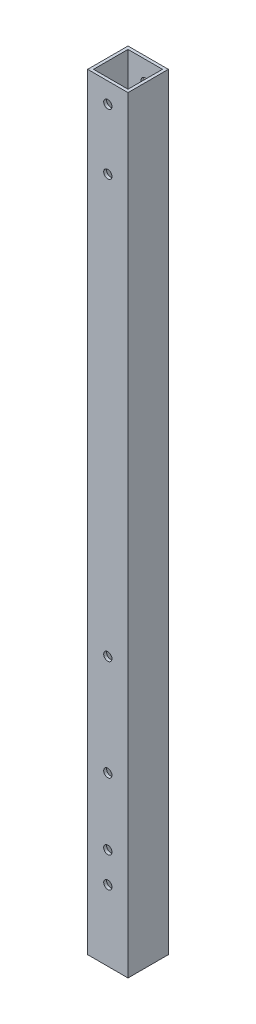
ISO-10303-21;
HEADER;
FILE_DESCRIPTION(('STEP AP214'),'2;1');
FILE_NAME('part.step','',(''),(''),'','','');
FILE_SCHEMA(('AUTOMOTIVE_DESIGN { 1 0 10303 214 1 1 1 1 }'));
ENDSEC;
DATA;
#1=APPLICATION_CONTEXT('core data for automotive mechanical design processes');
#2=APPLICATION_PROTOCOL_DEFINITION('international standard','automotive_design',2000,#1);
#3=PRODUCT_CONTEXT('',#1,'mechanical');
#4=PRODUCT('Part','Part','',(#3));
#5=PRODUCT_RELATED_PRODUCT_CATEGORY('part','',(#4));
#6=PRODUCT_DEFINITION_FORMATION('','',#4);
#7=PRODUCT_DEFINITION_CONTEXT('part definition',#1,'design');
#8=PRODUCT_DEFINITION('design','',#6,#7);
#9=PRODUCT_DEFINITION_SHAPE('','',#8);
#10=(LENGTH_UNIT() NAMED_UNIT(*) SI_UNIT(.MILLI.,.METRE.));
#11=(NAMED_UNIT(*) PLANE_ANGLE_UNIT() SI_UNIT($,.RADIAN.));
#12=(NAMED_UNIT(*) SI_UNIT($,.STERADIAN.) SOLID_ANGLE_UNIT());
#13=UNCERTAINTY_MEASURE_WITH_UNIT(LENGTH_MEASURE(1.E-05),#10,'distance_accuracy_value','');
#14=(GEOMETRIC_REPRESENTATION_CONTEXT(3) GLOBAL_UNCERTAINTY_ASSIGNED_CONTEXT((#13)) GLOBAL_UNIT_ASSIGNED_CONTEXT((#10,
#11,#12)) REPRESENTATION_CONTEXT('',''));
#15=CARTESIAN_POINT('',(0.,0.,0.));
#16=DIRECTION('',(0.,0.,1.));
#17=DIRECTION('',(1.,0.,0.));
#18=AXIS2_PLACEMENT_3D('',#15,#16,#17);
#19=CARTESIAN_POINT('',(0.,350.,0.));
#20=DIRECTION('',(0.,-1.,0.));
#21=DIRECTION('',(0.,0.,-1.));
#22=AXIS2_PLACEMENT_3D('',#19,#20,#21);
#23=PLANE('',#22);
#24=DIRECTION('',(0.,0.,1.));
#25=VECTOR('',#24,1.);
#26=CARTESIAN_POINT('',(0.,350.,0.));
#27=LINE('',#26,#25);
#28=CARTESIAN_POINT('',(0.,350.,-20.));
#29=VERTEX_POINT('',#28);
#30=CARTESIAN_POINT('',(0.,350.,0.));
#31=VERTEX_POINT('',#30);
#32=EDGE_CURVE('E211',#29,#31,#27,.T.);
#33=ORIENTED_EDGE('',*,*,#32,.T.);
#34=DIRECTION('',(1.,0.,0.));
#35=VECTOR('',#34,1.);
#36=CARTESIAN_POINT('',(0.,350.,0.));
#37=LINE('',#36,#35);
#38=CARTESIAN_POINT('',(20.,350.,0.));
#39=VERTEX_POINT('',#38);
#40=EDGE_CURVE('E213',#31,#39,#37,.T.);
#41=ORIENTED_EDGE('',*,*,#40,.T.);
#42=DIRECTION('',(0.,0.,-1.));
#43=VECTOR('',#42,1.);
#44=CARTESIAN_POINT('',(20.,350.,0.));
#45=LINE('',#44,#43);
#46=CARTESIAN_POINT('',(20.,350.,-20.));
#47=VERTEX_POINT('',#46);
#48=EDGE_CURVE('E215',#39,#47,#45,.T.);
#49=ORIENTED_EDGE('',*,*,#48,.T.);
#50=DIRECTION('',(-1.,0.,0.));
#51=VECTOR('',#50,1.);
#52=CARTESIAN_POINT('',(0.,350.,-20.));
#53=LINE('',#52,#51);
#54=EDGE_CURVE('E60',#47,#29,#53,.T.);
#55=ORIENTED_EDGE('',*,*,#54,.T.);
#56=EDGE_LOOP('',(#33,#41,#49,#55));
#57=FACE_BOUND('',#56,.T.);
#58=DIRECTION('',(0.,0.,1.));
#59=VECTOR('',#58,1.);
#60=CARTESIAN_POINT('',(1.45,350.,-1.45));
#61=LINE('',#60,#59);
#62=CARTESIAN_POINT('',(1.45,350.,-18.55));
#63=VERTEX_POINT('',#62);
#64=CARTESIAN_POINT('',(1.45,350.,-1.45));
#65=VERTEX_POINT('',#64);
#66=EDGE_CURVE('E200',#63,#65,#61,.T.);
#67=ORIENTED_EDGE('',*,*,#66,.F.);
#68=DIRECTION('',(-1.,0.,0.));
#69=VECTOR('',#68,1.);
#70=CARTESIAN_POINT('',(1.45,350.,-18.55));
#71=LINE('',#70,#69);
#72=CARTESIAN_POINT('',(18.55,350.,-18.55));
#73=VERTEX_POINT('',#72);
#74=EDGE_CURVE('E205',#73,#63,#71,.T.);
#75=ORIENTED_EDGE('',*,*,#74,.F.);
#76=DIRECTION('',(0.,0.,-1.));
#77=VECTOR('',#76,1.);
#78=CARTESIAN_POINT('',(18.55,350.,-1.45));
#79=LINE('',#78,#77);
#80=CARTESIAN_POINT('',(18.55,350.,-1.45));
#81=VERTEX_POINT('',#80);
#82=EDGE_CURVE('E203',#81,#73,#79,.T.);
#83=ORIENTED_EDGE('',*,*,#82,.F.);
#84=DIRECTION('',(1.,0.,0.));
#85=VECTOR('',#84,1.);
#86=CARTESIAN_POINT('',(1.45,350.,-1.45));
#87=LINE('',#86,#85);
#88=EDGE_CURVE('E110',#65,#81,#87,.T.);
#89=ORIENTED_EDGE('',*,*,#88,.F.);
#90=EDGE_LOOP('',(#67,#75,#83,#89));
#91=FACE_BOUND('',#90,.T.);
#92=ADVANCED_FACE('F35',(#57,#91),#23,.F.);
#93=CARTESIAN_POINT('',(0.,350.,0.));
#94=DIRECTION('',(1.,0.,0.));
#95=DIRECTION('',(0.,0.,-1.));
#96=AXIS2_PLACEMENT_3D('',#93,#94,#95);
#97=PLANE('',#96);
#98=DIRECTION('',(0.,-1.,0.));
#99=VECTOR('',#98,1.);
#100=CARTESIAN_POINT('',(0.,350.,-20.));
#101=LINE('',#100,#99);
#102=CARTESIAN_POINT('',(0.,-30.,-20.));
#103=VERTEX_POINT('',#102);
#104=EDGE_CURVE('E218',#29,#103,#101,.T.);
#105=ORIENTED_EDGE('',*,*,#104,.T.);
#106=DIRECTION('',(0.,0.,-1.));
#107=VECTOR('',#106,1.);
#108=CARTESIAN_POINT('',(0.,-30.,0.));
#109=LINE('',#108,#107);
#110=CARTESIAN_POINT('',(0.,-30.,0.));
#111=VERTEX_POINT('',#110);
#112=EDGE_CURVE('E129',#111,#103,#109,.T.);
#113=ORIENTED_EDGE('',*,*,#112,.F.);
#114=DIRECTION('',(0.,-1.,0.));
#115=VECTOR('',#114,1.);
#116=CARTESIAN_POINT('',(0.,350.,0.));
#117=LINE('',#116,#115);
#118=EDGE_CURVE('E11',#31,#111,#117,.T.);
#119=ORIENTED_EDGE('',*,*,#118,.F.);
#120=ORIENTED_EDGE('',*,*,#32,.F.);
#121=EDGE_LOOP('',(#105,#113,#119,#120));
#122=FACE_BOUND('',#121,.T.);
#123=ADVANCED_FACE('F37',(#122),#97,.F.);
#124=CARTESIAN_POINT('',(0.,350.,0.));
#125=DIRECTION('',(0.,0.,-1.));
#126=DIRECTION('',(-1.,0.,0.));
#127=AXIS2_PLACEMENT_3D('',#124,#125,#126);
#128=PLANE('',#127);
#129=CARTESIAN_POINT('',(10.,103.,0.));
#130=DIRECTION('',(0.,0.,-1.));
#131=DIRECTION('',(-1.,0.,0.));
#132=AXIS2_PLACEMENT_3D('',#129,#130,#131);
#133=CIRCLE('',#132,2.05000000000001);
#134=CARTESIAN_POINT('',(7.94999999999999,103.,0.));
#135=VERTEX_POINT('',#134);
#136=EDGE_CURVE('E142',#135,#135,#133,.T.);
#137=ORIENTED_EDGE('',*,*,#136,.T.);
#138=EDGE_LOOP('',(#137));
#139=FACE_BOUND('',#138,.T.);
#140=CARTESIAN_POINT('',(10.,53.,0.));
#141=DIRECTION('',(0.,0.,-1.));
#142=DIRECTION('',(-1.,0.,0.));
#143=AXIS2_PLACEMENT_3D('',#140,#141,#142);
#144=CIRCLE('',#143,2.05000000000001);
#145=CARTESIAN_POINT('',(7.94999999999999,53.,0.));
#146=VERTEX_POINT('',#145);
#147=EDGE_CURVE('E149',#146,#146,#144,.T.);
#148=ORIENTED_EDGE('',*,*,#147,.T.);
#149=EDGE_LOOP('',(#148));
#150=FACE_BOUND('',#149,.T.);
#151=CARTESIAN_POINT('',(10.,340.,0.));
#152=DIRECTION('',(0.,0.,-1.));
#153=DIRECTION('',(-1.,0.,0.));
#154=AXIS2_PLACEMENT_3D('',#151,#152,#153);
#155=CIRCLE('',#154,2.05000000000003);
#156=CARTESIAN_POINT('',(7.94999999999997,340.,0.));
#157=VERTEX_POINT('',#156);
#158=EDGE_CURVE('E161',#157,#157,#155,.T.);
#159=ORIENTED_EDGE('',*,*,#158,.T.);
#160=EDGE_LOOP('',(#159));
#161=FACE_BOUND('',#160,.T.);
#162=CARTESIAN_POINT('',(10.,310.,0.));
#163=DIRECTION('',(0.,0.,-1.));
#164=DIRECTION('',(-1.,0.,0.));
#165=AXIS2_PLACEMENT_3D('',#162,#163,#164);
#166=CIRCLE('',#165,2.05000000000004);
#167=CARTESIAN_POINT('',(7.94999999999996,310.,0.));
#168=VERTEX_POINT('',#167);
#169=EDGE_CURVE('E168',#168,#168,#166,.T.);
#170=ORIENTED_EDGE('',*,*,#169,.T.);
#171=EDGE_LOOP('',(#170));
#172=FACE_BOUND('',#171,.T.);
#173=CARTESIAN_POINT('',(10.,20.,0.));
#174=DIRECTION('',(0.,0.,-1.));
#175=DIRECTION('',(-1.,0.,0.));
#176=AXIS2_PLACEMENT_3D('',#173,#174,#175);
#177=CIRCLE('',#176,2.05000000000001);
#178=CARTESIAN_POINT('',(7.94999999999999,20.,0.));
#179=VERTEX_POINT('',#178);
#180=EDGE_CURVE('E174',#179,#179,#177,.T.);
#181=ORIENTED_EDGE('',*,*,#180,.T.);
#182=EDGE_LOOP('',(#181));
#183=FACE_BOUND('',#182,.T.);
#184=CARTESIAN_POINT('',(10.,5.,0.));
#185=DIRECTION('',(0.,0.,-1.));
#186=DIRECTION('',(-1.,0.,0.));
#187=AXIS2_PLACEMENT_3D('',#184,#185,#186);
#188=CIRCLE('',#187,2.05000000000001);
#189=CARTESIAN_POINT('',(7.94999999999999,5.,0.));
#190=VERTEX_POINT('',#189);
#191=EDGE_CURVE('E180',#190,#190,#188,.T.);
#192=ORIENTED_EDGE('',*,*,#191,.T.);
#193=EDGE_LOOP('',(#192));
#194=FACE_BOUND('',#193,.T.);
#195=ORIENTED_EDGE('',*,*,#118,.T.);
#196=DIRECTION('',(-1.,0.,0.));
#197=VECTOR('',#196,1.);
#198=CARTESIAN_POINT('',(0.,-30.,0.));
#199=LINE('',#198,#197);
#200=CARTESIAN_POINT('',(20.,-30.,0.));
#201=VERTEX_POINT('',#200);
#202=EDGE_CURVE('E138',#201,#111,#199,.T.);
#203=ORIENTED_EDGE('',*,*,#202,.F.);
#204=DIRECTION('',(0.,-1.,0.));
#205=VECTOR('',#204,1.);
#206=CARTESIAN_POINT('',(20.,350.,0.));
#207=LINE('',#206,#205);
#208=EDGE_CURVE('E44',#39,#201,#207,.T.);
#209=ORIENTED_EDGE('',*,*,#208,.F.);
#210=ORIENTED_EDGE('',*,*,#40,.F.);
#211=EDGE_LOOP('',(#195,#203,#209,#210));
#212=FACE_BOUND('',#211,.T.);
#213=ADVANCED_FACE('F260',(#139,#150,#161,#172,#183,#194,#212),#128,.F.);
#214=CARTESIAN_POINT('',(20.,350.,0.));
#215=DIRECTION('',(-1.,0.,0.));
#216=DIRECTION('',(0.,0.,1.));
#217=AXIS2_PLACEMENT_3D('',#214,#215,#216);
#218=PLANE('',#217);
#219=ORIENTED_EDGE('',*,*,#208,.T.);
#220=DIRECTION('',(0.,0.,1.));
#221=VECTOR('',#220,1.);
#222=CARTESIAN_POINT('',(20.,-30.,0.));
#223=LINE('',#222,#221);
#224=CARTESIAN_POINT('',(20.,-30.,-20.));
#225=VERTEX_POINT('',#224);
#226=EDGE_CURVE('E135',#225,#201,#223,.T.);
#227=ORIENTED_EDGE('',*,*,#226,.F.);
#228=DIRECTION('',(0.,-1.,0.));
#229=VECTOR('',#228,1.);
#230=CARTESIAN_POINT('',(20.,350.,-20.));
#231=LINE('',#230,#229);
#232=EDGE_CURVE('E220',#47,#225,#231,.T.);
#233=ORIENTED_EDGE('',*,*,#232,.F.);
#234=ORIENTED_EDGE('',*,*,#48,.F.);
#235=EDGE_LOOP('',(#219,#227,#233,#234));
#236=FACE_BOUND('',#235,.T.);
#237=ADVANCED_FACE('F268',(#236),#218,.F.);
#238=CARTESIAN_POINT('',(0.,350.,-20.));
#239=DIRECTION('',(0.,0.,1.));
#240=DIRECTION('',(1.,0.,0.));
#241=AXIS2_PLACEMENT_3D('',#238,#239,#240);
#242=PLANE('',#241);
#243=CARTESIAN_POINT('',(10.,103.,-20.));
#244=DIRECTION('',(0.,0.,-1.));
#245=DIRECTION('',(-1.,0.,0.));
#246=AXIS2_PLACEMENT_3D('',#243,#244,#245);
#247=CIRCLE('',#246,2.05000000000001);
#248=CARTESIAN_POINT('',(7.94999999999999,103.,-20.));
#249=VERTEX_POINT('',#248);
#250=EDGE_CURVE('E146',#249,#249,#247,.T.);
#251=ORIENTED_EDGE('',*,*,#250,.F.);
#252=EDGE_LOOP('',(#251));
#253=FACE_BOUND('',#252,.T.);
#254=CARTESIAN_POINT('',(10.,53.,-20.));
#255=DIRECTION('',(0.,0.,-1.));
#256=DIRECTION('',(-1.,0.,0.));
#257=AXIS2_PLACEMENT_3D('',#254,#255,#256);
#258=CIRCLE('',#257,2.05000000000001);
#259=CARTESIAN_POINT('',(7.94999999999999,53.,-20.));
#260=VERTEX_POINT('',#259);
#261=EDGE_CURVE('E141',#260,#260,#258,.T.);
#262=ORIENTED_EDGE('',*,*,#261,.F.);
#263=EDGE_LOOP('',(#262));
#264=FACE_BOUND('',#263,.T.);
#265=CARTESIAN_POINT('',(10.,340.,-20.));
#266=DIRECTION('',(0.,0.,-1.));
#267=DIRECTION('',(-1.,0.,0.));
#268=AXIS2_PLACEMENT_3D('',#265,#266,#267);
#269=CIRCLE('',#268,2.05000000000003);
#270=CARTESIAN_POINT('',(7.94999999999997,340.,-20.));
#271=VERTEX_POINT('',#270);
#272=EDGE_CURVE('E165',#271,#271,#269,.T.);
#273=ORIENTED_EDGE('',*,*,#272,.F.);
#274=EDGE_LOOP('',(#273));
#275=FACE_BOUND('',#274,.T.);
#276=CARTESIAN_POINT('',(10.,310.,-20.));
#277=DIRECTION('',(0.,0.,-1.));
#278=DIRECTION('',(-1.,0.,0.));
#279=AXIS2_PLACEMENT_3D('',#276,#277,#278);
#280=CIRCLE('',#279,2.05000000000004);
#281=CARTESIAN_POINT('',(7.94999999999996,310.,-20.));
#282=VERTEX_POINT('',#281);
#283=EDGE_CURVE('E171',#282,#282,#280,.T.);
#284=ORIENTED_EDGE('',*,*,#283,.F.);
#285=EDGE_LOOP('',(#284));
#286=FACE_BOUND('',#285,.T.);
#287=CARTESIAN_POINT('',(10.,20.,-20.));
#288=DIRECTION('',(0.,0.,-1.));
#289=DIRECTION('',(-1.,0.,0.));
#290=AXIS2_PLACEMENT_3D('',#287,#288,#289);
#291=CIRCLE('',#290,2.05000000000001);
#292=CARTESIAN_POINT('',(7.94999999999999,20.,-20.));
#293=VERTEX_POINT('',#292);
#294=EDGE_CURVE('E177',#293,#293,#291,.T.);
#295=ORIENTED_EDGE('',*,*,#294,.F.);
#296=EDGE_LOOP('',(#295));
#297=FACE_BOUND('',#296,.T.);
#298=CARTESIAN_POINT('',(10.,5.,-20.));
#299=DIRECTION('',(0.,0.,-1.));
#300=DIRECTION('',(-1.,0.,0.));
#301=AXIS2_PLACEMENT_3D('',#298,#299,#300);
#302=CIRCLE('',#301,2.05000000000001);
#303=CARTESIAN_POINT('',(7.94999999999999,5.,-20.));
#304=VERTEX_POINT('',#303);
#305=EDGE_CURVE('E160',#304,#304,#302,.T.);
#306=ORIENTED_EDGE('',*,*,#305,.F.);
#307=EDGE_LOOP('',(#306));
#308=FACE_BOUND('',#307,.T.);
#309=ORIENTED_EDGE('',*,*,#232,.T.);
#310=DIRECTION('',(1.,0.,0.));
#311=VECTOR('',#310,1.);
#312=CARTESIAN_POINT('',(0.,-30.,-20.));
#313=LINE('',#312,#311);
#314=EDGE_CURVE('E132',#103,#225,#313,.T.);
#315=ORIENTED_EDGE('',*,*,#314,.F.);
#316=ORIENTED_EDGE('',*,*,#104,.F.);
#317=ORIENTED_EDGE('',*,*,#54,.F.);
#318=EDGE_LOOP('',(#309,#315,#316,#317));
#319=FACE_BOUND('',#318,.T.);
#320=ADVANCED_FACE('F265',(#253,#264,#275,#286,#297,#308,#319),#242,.F.);
#321=CARTESIAN_POINT('',(1.45,350.,-1.45));
#322=DIRECTION('',(1.,0.,0.));
#323=DIRECTION('',(0.,0.,-1.));
#324=AXIS2_PLACEMENT_3D('',#321,#322,#323);
#325=PLANE('',#324);
#326=DIRECTION('',(0.,-1.,0.));
#327=VECTOR('',#326,1.);
#328=CARTESIAN_POINT('',(1.45,350.,-1.45));
#329=LINE('',#328,#327);
#330=CARTESIAN_POINT('',(1.45,-30.,-1.45));
#331=VERTEX_POINT('',#330);
#332=EDGE_CURVE('E113',#65,#331,#329,.T.);
#333=ORIENTED_EDGE('',*,*,#332,.T.);
#334=DIRECTION('',(0.,0.,-1.));
#335=VECTOR('',#334,1.);
#336=CARTESIAN_POINT('',(1.45,-30.,-18.55));
#337=LINE('',#336,#335);
#338=CARTESIAN_POINT('',(1.45,-30.,-18.55));
#339=VERTEX_POINT('',#338);
#340=EDGE_CURVE('E123',#331,#339,#337,.T.);
#341=ORIENTED_EDGE('',*,*,#340,.T.);
#342=DIRECTION('',(0.,-1.,0.));
#343=VECTOR('',#342,1.);
#344=CARTESIAN_POINT('',(1.45,350.,-18.55));
#345=LINE('',#344,#343);
#346=EDGE_CURVE('E207',#63,#339,#345,.T.);
#347=ORIENTED_EDGE('',*,*,#346,.F.);
#348=ORIENTED_EDGE('',*,*,#66,.T.);
#349=EDGE_LOOP('',(#333,#341,#347,#348));
#350=FACE_BOUND('',#349,.T.);
#351=ADVANCED_FACE('F253',(#350),#325,.T.);
#352=CARTESIAN_POINT('',(1.45,350.,-1.45));
#353=DIRECTION('',(0.,0.,-1.));
#354=DIRECTION('',(-1.,0.,0.));
#355=AXIS2_PLACEMENT_3D('',#352,#353,#354);
#356=PLANE('',#355);
#357=CARTESIAN_POINT('',(10.,103.,-1.45));
#358=DIRECTION('',(0.,0.,-1.));
#359=DIRECTION('',(-1.,0.,0.));
#360=AXIS2_PLACEMENT_3D('',#357,#358,#359);
#361=CIRCLE('',#360,2.05000000000001);
#362=CARTESIAN_POINT('',(7.94999999999999,103.,-1.45));
#363=VERTEX_POINT('',#362);
#364=EDGE_CURVE('E157',#363,#363,#361,.T.);
#365=ORIENTED_EDGE('',*,*,#364,.F.);
#366=EDGE_LOOP('',(#365));
#367=FACE_BOUND('',#366,.T.);
#368=CARTESIAN_POINT('',(10.,53.,-1.45));
#369=DIRECTION('',(0.,0.,-1.));
#370=DIRECTION('',(-1.,0.,0.));
#371=AXIS2_PLACEMENT_3D('',#368,#369,#370);
#372=CIRCLE('',#371,2.05000000000001);
#373=CARTESIAN_POINT('',(7.94999999999999,53.,-1.45));
#374=VERTEX_POINT('',#373);
#375=EDGE_CURVE('E154',#374,#374,#372,.T.);
#376=ORIENTED_EDGE('',*,*,#375,.F.);
#377=EDGE_LOOP('',(#376));
#378=FACE_BOUND('',#377,.T.);
#379=CARTESIAN_POINT('',(10.,340.,-1.45));
#380=DIRECTION('',(0.,0.,-1.));
#381=DIRECTION('',(-1.,0.,0.));
#382=AXIS2_PLACEMENT_3D('',#379,#380,#381);
#383=CIRCLE('',#382,2.05000000000003);
#384=CARTESIAN_POINT('',(7.94999999999997,340.,-1.45));
#385=VERTEX_POINT('',#384);
#386=EDGE_CURVE('E197',#385,#385,#383,.T.);
#387=ORIENTED_EDGE('',*,*,#386,.F.);
#388=EDGE_LOOP('',(#387));
#389=FACE_BOUND('',#388,.T.);
#390=CARTESIAN_POINT('',(10.,310.,-1.45));
#391=DIRECTION('',(0.,0.,-1.));
#392=DIRECTION('',(-1.,0.,0.));
#393=AXIS2_PLACEMENT_3D('',#390,#391,#392);
#394=CIRCLE('',#393,2.05000000000004);
#395=CARTESIAN_POINT('',(7.94999999999996,310.,-1.45));
#396=VERTEX_POINT('',#395);
#397=EDGE_CURVE('E193',#396,#396,#394,.T.);
#398=ORIENTED_EDGE('',*,*,#397,.F.);
#399=EDGE_LOOP('',(#398));
#400=FACE_BOUND('',#399,.T.);
#401=CARTESIAN_POINT('',(10.,20.,-1.45));
#402=DIRECTION('',(0.,0.,-1.));
#403=DIRECTION('',(-1.,0.,0.));
#404=AXIS2_PLACEMENT_3D('',#401,#402,#403);
#405=CIRCLE('',#404,2.05000000000001);
#406=CARTESIAN_POINT('',(7.94999999999999,20.,-1.45));
#407=VERTEX_POINT('',#406);
#408=EDGE_CURVE('E189',#407,#407,#405,.T.);
#409=ORIENTED_EDGE('',*,*,#408,.F.);
#410=EDGE_LOOP('',(#409));
#411=FACE_BOUND('',#410,.T.);
#412=CARTESIAN_POINT('',(10.,5.,-1.45));
#413=DIRECTION('',(0.,0.,-1.));
#414=DIRECTION('',(-1.,0.,0.));
#415=AXIS2_PLACEMENT_3D('',#412,#413,#414);
#416=CIRCLE('',#415,2.05000000000001);
#417=CARTESIAN_POINT('',(7.94999999999999,5.,-1.45));
#418=VERTEX_POINT('',#417);
#419=EDGE_CURVE('E185',#418,#418,#416,.T.);
#420=ORIENTED_EDGE('',*,*,#419,.F.);
#421=EDGE_LOOP('',(#420));
#422=FACE_BOUND('',#421,.T.);
#423=DIRECTION('',(0.,-1.,0.));
#424=VECTOR('',#423,1.);
#425=CARTESIAN_POINT('',(18.55,350.,-1.45));
#426=LINE('',#425,#424);
#427=CARTESIAN_POINT('',(18.55,-30.,-1.45));
#428=VERTEX_POINT('',#427);
#429=EDGE_CURVE('E102',#81,#428,#426,.T.);
#430=ORIENTED_EDGE('',*,*,#429,.T.);
#431=DIRECTION('',(-1.,0.,0.));
#432=VECTOR('',#431,1.);
#433=CARTESIAN_POINT('',(18.55,-30.,-1.45));
#434=LINE('',#433,#432);
#435=EDGE_CURVE('E107',#428,#331,#434,.T.);
#436=ORIENTED_EDGE('',*,*,#435,.T.);
#437=ORIENTED_EDGE('',*,*,#332,.F.);
#438=ORIENTED_EDGE('',*,*,#88,.T.);
#439=EDGE_LOOP('',(#430,#436,#437,#438));
#440=FACE_BOUND('',#439,.T.);
#441=ADVANCED_FACE('F104',(#367,#378,#389,#400,#411,#422,#440),#356,.T.);
#442=CARTESIAN_POINT('',(18.55,350.,-1.45));
#443=DIRECTION('',(-1.,0.,0.));
#444=DIRECTION('',(0.,0.,1.));
#445=AXIS2_PLACEMENT_3D('',#442,#443,#444);
#446=PLANE('',#445);
#447=DIRECTION('',(0.,-1.,0.));
#448=VECTOR('',#447,1.);
#449=CARTESIAN_POINT('',(18.55,350.,-18.55));
#450=LINE('',#449,#448);
#451=CARTESIAN_POINT('',(18.55,-30.,-18.55));
#452=VERTEX_POINT('',#451);
#453=EDGE_CURVE('E52',#73,#452,#450,.T.);
#454=ORIENTED_EDGE('',*,*,#453,.T.);
#455=DIRECTION('',(0.,0.,1.));
#456=VECTOR('',#455,1.);
#457=CARTESIAN_POINT('',(18.55,-30.,-18.55));
#458=LINE('',#457,#456);
#459=EDGE_CURVE('E116',#452,#428,#458,.T.);
#460=ORIENTED_EDGE('',*,*,#459,.T.);
#461=ORIENTED_EDGE('',*,*,#429,.F.);
#462=ORIENTED_EDGE('',*,*,#82,.T.);
#463=EDGE_LOOP('',(#454,#460,#461,#462));
#464=FACE_BOUND('',#463,.T.);
#465=ADVANCED_FACE('F117',(#464),#446,.T.);
#466=CARTESIAN_POINT('',(1.45,350.,-18.55));
#467=DIRECTION('',(0.,0.,1.));
#468=DIRECTION('',(1.,0.,0.));
#469=AXIS2_PLACEMENT_3D('',#466,#467,#468);
#470=PLANE('',#469);
#471=CARTESIAN_POINT('',(10.,103.,-18.55));
#472=DIRECTION('',(0.,0.,1.));
#473=DIRECTION('',(1.,0.,0.));
#474=AXIS2_PLACEMENT_3D('',#471,#472,#473);
#475=CIRCLE('',#474,2.05000000000001);
#476=CARTESIAN_POINT('',(12.05,103.,-18.55));
#477=VERTEX_POINT('',#476);
#478=EDGE_CURVE('E39',#477,#477,#475,.T.);
#479=ORIENTED_EDGE('',*,*,#478,.F.);
#480=EDGE_LOOP('',(#479));
#481=FACE_BOUND('',#480,.T.);
#482=CARTESIAN_POINT('',(10.,53.,-18.55));
#483=DIRECTION('',(0.,0.,1.));
#484=DIRECTION('',(1.,0.,0.));
#485=AXIS2_PLACEMENT_3D('',#482,#483,#484);
#486=CIRCLE('',#485,2.05000000000001);
#487=CARTESIAN_POINT('',(12.05,53.,-18.55));
#488=VERTEX_POINT('',#487);
#489=EDGE_CURVE('E145',#488,#488,#486,.T.);
#490=ORIENTED_EDGE('',*,*,#489,.F.);
#491=EDGE_LOOP('',(#490));
#492=FACE_BOUND('',#491,.T.);
#493=CARTESIAN_POINT('',(10.,340.,-18.55));
#494=DIRECTION('',(0.,0.,1.));
#495=DIRECTION('',(1.,0.,0.));
#496=AXIS2_PLACEMENT_3D('',#493,#494,#495);
#497=CIRCLE('',#496,2.05000000000003);
#498=CARTESIAN_POINT('',(12.05,340.,-18.55));
#499=VERTEX_POINT('',#498);
#500=EDGE_CURVE('E196',#499,#499,#497,.T.);
#501=ORIENTED_EDGE('',*,*,#500,.F.);
#502=EDGE_LOOP('',(#501));
#503=FACE_BOUND('',#502,.T.);
#504=CARTESIAN_POINT('',(10.,310.,-18.55));
#505=DIRECTION('',(0.,0.,1.));
#506=DIRECTION('',(1.,0.,0.));
#507=AXIS2_PLACEMENT_3D('',#504,#505,#506);
#508=CIRCLE('',#507,2.05000000000004);
#509=CARTESIAN_POINT('',(12.05,310.,-18.55));
#510=VERTEX_POINT('',#509);
#511=EDGE_CURVE('E192',#510,#510,#508,.T.);
#512=ORIENTED_EDGE('',*,*,#511,.F.);
#513=EDGE_LOOP('',(#512));
#514=FACE_BOUND('',#513,.T.);
#515=CARTESIAN_POINT('',(10.,20.,-18.55));
#516=DIRECTION('',(0.,0.,1.));
#517=DIRECTION('',(1.,0.,0.));
#518=AXIS2_PLACEMENT_3D('',#515,#516,#517);
#519=CIRCLE('',#518,2.05000000000001);
#520=CARTESIAN_POINT('',(12.05,20.,-18.55));
#521=VERTEX_POINT('',#520);
#522=EDGE_CURVE('E188',#521,#521,#519,.T.);
#523=ORIENTED_EDGE('',*,*,#522,.F.);
#524=EDGE_LOOP('',(#523));
#525=FACE_BOUND('',#524,.T.);
#526=CARTESIAN_POINT('',(10.,5.,-18.55));
#527=DIRECTION('',(0.,0.,1.));
#528=DIRECTION('',(1.,0.,0.));
#529=AXIS2_PLACEMENT_3D('',#526,#527,#528);
#530=CIRCLE('',#529,2.05000000000001);
#531=CARTESIAN_POINT('',(12.05,5.,-18.55));
#532=VERTEX_POINT('',#531);
#533=EDGE_CURVE('E164',#532,#532,#530,.T.);
#534=ORIENTED_EDGE('',*,*,#533,.F.);
#535=EDGE_LOOP('',(#534));
#536=FACE_BOUND('',#535,.T.);
#537=ORIENTED_EDGE('',*,*,#346,.T.);
#538=DIRECTION('',(1.,0.,0.));
#539=VECTOR('',#538,1.);
#540=CARTESIAN_POINT('',(18.55,-30.,-18.55));
#541=LINE('',#540,#539);
#542=EDGE_CURVE('E125',#339,#452,#541,.T.);
#543=ORIENTED_EDGE('',*,*,#542,.T.);
#544=ORIENTED_EDGE('',*,*,#453,.F.);
#545=ORIENTED_EDGE('',*,*,#74,.T.);
#546=EDGE_LOOP('',(#537,#543,#544,#545));
#547=FACE_BOUND('',#546,.T.);
#548=ADVANCED_FACE('F236',(#481,#492,#503,#514,#525,#536,#547),#470,.T.);
#549=CARTESIAN_POINT('',(10.,5.,0.));
#550=DIRECTION('',(0.,0.,-1.));
#551=DIRECTION('',(-1.,0.,0.));
#552=AXIS2_PLACEMENT_3D('',#549,#550,#551);
#553=CYLINDRICAL_SURFACE('',#552,2.05000000000001);
#554=ORIENTED_EDGE('',*,*,#533,.T.);
#555=EDGE_LOOP('',(#554));
#556=FACE_BOUND('',#555,.T.);
#557=ORIENTED_EDGE('',*,*,#305,.T.);
#558=EDGE_LOOP('',(#557));
#559=FACE_BOUND('',#558,.T.);
#560=ADVANCED_FACE('F239',(#556,#559),#553,.F.);
#561=CARTESIAN_POINT('',(10.,20.,0.));
#562=DIRECTION('',(0.,0.,-1.));
#563=DIRECTION('',(-1.,0.,0.));
#564=AXIS2_PLACEMENT_3D('',#561,#562,#563);
#565=CYLINDRICAL_SURFACE('',#564,2.05000000000001);
#566=ORIENTED_EDGE('',*,*,#522,.T.);
#567=EDGE_LOOP('',(#566));
#568=FACE_BOUND('',#567,.T.);
#569=ORIENTED_EDGE('',*,*,#294,.T.);
#570=EDGE_LOOP('',(#569));
#571=FACE_BOUND('',#570,.T.);
#572=ADVANCED_FACE('F323',(#568,#571),#565,.F.);
#573=CARTESIAN_POINT('',(10.,310.,0.));
#574=DIRECTION('',(0.,0.,-1.));
#575=DIRECTION('',(-1.,0.,0.));
#576=AXIS2_PLACEMENT_3D('',#573,#574,#575);
#577=CYLINDRICAL_SURFACE('',#576,2.05000000000004);
#578=ORIENTED_EDGE('',*,*,#511,.T.);
#579=EDGE_LOOP('',(#578));
#580=FACE_BOUND('',#579,.T.);
#581=ORIENTED_EDGE('',*,*,#283,.T.);
#582=EDGE_LOOP('',(#581));
#583=FACE_BOUND('',#582,.T.);
#584=ADVANCED_FACE('F319',(#580,#583),#577,.F.);
#585=CARTESIAN_POINT('',(10.,340.,0.));
#586=DIRECTION('',(0.,0.,-1.));
#587=DIRECTION('',(-1.,0.,0.));
#588=AXIS2_PLACEMENT_3D('',#585,#586,#587);
#589=CYLINDRICAL_SURFACE('',#588,2.05000000000003);
#590=ORIENTED_EDGE('',*,*,#500,.T.);
#591=EDGE_LOOP('',(#590));
#592=FACE_BOUND('',#591,.T.);
#593=ORIENTED_EDGE('',*,*,#272,.T.);
#594=EDGE_LOOP('',(#593));
#595=FACE_BOUND('',#594,.T.);
#596=ADVANCED_FACE('F315',(#592,#595),#589,.F.);
#597=ORIENTED_EDGE('',*,*,#419,.T.);
#598=EDGE_LOOP('',(#597));
#599=FACE_BOUND('',#598,.T.);
#600=ORIENTED_EDGE('',*,*,#191,.F.);
#601=EDGE_LOOP('',(#600));
#602=FACE_BOUND('',#601,.T.);
#603=ADVANCED_FACE('F318',(#599,#602),#553,.F.);
#604=ORIENTED_EDGE('',*,*,#408,.T.);
#605=EDGE_LOOP('',(#604));
#606=FACE_BOUND('',#605,.T.);
#607=ORIENTED_EDGE('',*,*,#180,.F.);
#608=EDGE_LOOP('',(#607));
#609=FACE_BOUND('',#608,.T.);
#610=ADVANCED_FACE('F329',(#606,#609),#565,.F.);
#611=ORIENTED_EDGE('',*,*,#397,.T.);
#612=EDGE_LOOP('',(#611));
#613=FACE_BOUND('',#612,.T.);
#614=ORIENTED_EDGE('',*,*,#169,.F.);
#615=EDGE_LOOP('',(#614));
#616=FACE_BOUND('',#615,.T.);
#617=ADVANCED_FACE('F325',(#613,#616),#577,.F.);
#618=ORIENTED_EDGE('',*,*,#386,.T.);
#619=EDGE_LOOP('',(#618));
#620=FACE_BOUND('',#619,.T.);
#621=ORIENTED_EDGE('',*,*,#158,.F.);
#622=EDGE_LOOP('',(#621));
#623=FACE_BOUND('',#622,.T.);
#624=ADVANCED_FACE('F314',(#620,#623),#589,.F.);
#625=CARTESIAN_POINT('',(10.,53.,0.));
#626=DIRECTION('',(0.,0.,-1.));
#627=DIRECTION('',(-1.,0.,0.));
#628=AXIS2_PLACEMENT_3D('',#625,#626,#627);
#629=CYLINDRICAL_SURFACE('',#628,2.05000000000001);
#630=ORIENTED_EDGE('',*,*,#489,.T.);
#631=EDGE_LOOP('',(#630));
#632=FACE_BOUND('',#631,.T.);
#633=ORIENTED_EDGE('',*,*,#261,.T.);
#634=EDGE_LOOP('',(#633));
#635=FACE_BOUND('',#634,.T.);
#636=ADVANCED_FACE('F233',(#632,#635),#629,.F.);
#637=CARTESIAN_POINT('',(10.,103.,0.));
#638=DIRECTION('',(0.,0.,-1.));
#639=DIRECTION('',(-1.,0.,0.));
#640=AXIS2_PLACEMENT_3D('',#637,#638,#639);
#641=CYLINDRICAL_SURFACE('',#640,2.05000000000001);
#642=ORIENTED_EDGE('',*,*,#478,.T.);
#643=EDGE_LOOP('',(#642));
#644=FACE_BOUND('',#643,.T.);
#645=ORIENTED_EDGE('',*,*,#250,.T.);
#646=EDGE_LOOP('',(#645));
#647=FACE_BOUND('',#646,.T.);
#648=ADVANCED_FACE('F308',(#644,#647),#641,.F.);
#649=ORIENTED_EDGE('',*,*,#375,.T.);
#650=EDGE_LOOP('',(#649));
#651=FACE_BOUND('',#650,.T.);
#652=ORIENTED_EDGE('',*,*,#147,.F.);
#653=EDGE_LOOP('',(#652));
#654=FACE_BOUND('',#653,.T.);
#655=ADVANCED_FACE('F305',(#651,#654),#629,.F.);
#656=ORIENTED_EDGE('',*,*,#364,.T.);
#657=EDGE_LOOP('',(#656));
#658=FACE_BOUND('',#657,.T.);
#659=ORIENTED_EDGE('',*,*,#136,.F.);
#660=EDGE_LOOP('',(#659));
#661=FACE_BOUND('',#660,.T.);
#662=ADVANCED_FACE('F300',(#658,#661),#641,.F.);
#663=CARTESIAN_POINT('',(0.,-30.,0.));
#664=DIRECTION('',(0.,-1.,0.));
#665=DIRECTION('',(0.,0.,-1.));
#666=AXIS2_PLACEMENT_3D('',#663,#664,#665);
#667=PLANE('',#666);
#668=ORIENTED_EDGE('',*,*,#112,.T.);
#669=ORIENTED_EDGE('',*,*,#314,.T.);
#670=ORIENTED_EDGE('',*,*,#226,.T.);
#671=ORIENTED_EDGE('',*,*,#202,.T.);
#672=EDGE_LOOP('',(#668,#669,#670,#671));
#673=FACE_BOUND('',#672,.T.);
#674=ORIENTED_EDGE('',*,*,#435,.F.);
#675=ORIENTED_EDGE('',*,*,#459,.F.);
#676=ORIENTED_EDGE('',*,*,#542,.F.);
#677=ORIENTED_EDGE('',*,*,#340,.F.);
#678=EDGE_LOOP('',(#674,#675,#676,#677));
#679=FACE_BOUND('',#678,.T.);
#680=ADVANCED_FACE('F121',(#673,#679),#667,.T.);
#681=CLOSED_SHELL('',(#92,#123,#213,#237,#320,#351,#441,#465,#548,#560,#572,#584,#596,#603,#610,
#617,#624,#636,#648,#655,#662,#680));
#682=MANIFOLD_SOLID_BREP('B2',#681);
#683=ADVANCED_BREP_SHAPE_REPRESENTATION('',(#18,#682),#14);
#684=SHAPE_DEFINITION_REPRESENTATION(#9,#683);
ENDSEC;
END-ISO-10303-21;
